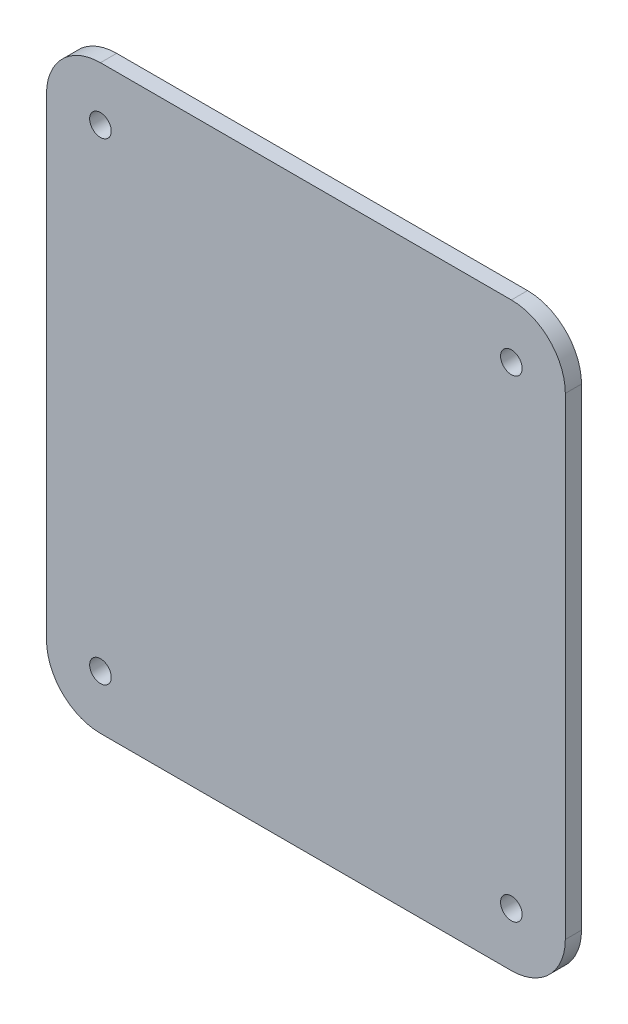
ISO-10303-21;
HEADER;
FILE_DESCRIPTION(('STEP AP214'),'2;1');
FILE_NAME('part.step','',(''),(''),'','','');
FILE_SCHEMA(('AUTOMOTIVE_DESIGN { 1 0 10303 214 1 1 1 1 }'));
ENDSEC;
DATA;
#1=APPLICATION_CONTEXT('core data for automotive mechanical design processes');
#2=APPLICATION_PROTOCOL_DEFINITION('international standard','automotive_design',2000,#1);
#3=PRODUCT_CONTEXT('',#1,'mechanical');
#4=PRODUCT('Part','Part','',(#3));
#5=PRODUCT_RELATED_PRODUCT_CATEGORY('part','',(#4));
#6=PRODUCT_DEFINITION_FORMATION('','',#4);
#7=PRODUCT_DEFINITION_CONTEXT('part definition',#1,'design');
#8=PRODUCT_DEFINITION('design','',#6,#7);
#9=PRODUCT_DEFINITION_SHAPE('','',#8);
#10=(LENGTH_UNIT() NAMED_UNIT(*) SI_UNIT(.MILLI.,.METRE.));
#11=(NAMED_UNIT(*) PLANE_ANGLE_UNIT() SI_UNIT($,.RADIAN.));
#12=(NAMED_UNIT(*) SI_UNIT($,.STERADIAN.) SOLID_ANGLE_UNIT());
#13=UNCERTAINTY_MEASURE_WITH_UNIT(LENGTH_MEASURE(1.E-05),#10,'distance_accuracy_value','');
#14=(GEOMETRIC_REPRESENTATION_CONTEXT(3) GLOBAL_UNCERTAINTY_ASSIGNED_CONTEXT((#13)) GLOBAL_UNIT_ASSIGNED_CONTEXT((#10,
#11,#12)) REPRESENTATION_CONTEXT('',''));
#15=CARTESIAN_POINT('',(0.,0.,0.));
#16=DIRECTION('',(0.,0.,1.));
#17=DIRECTION('',(1.,0.,0.));
#18=AXIS2_PLACEMENT_3D('',#15,#16,#17);
#19=CARTESIAN_POINT('',(36.15,-37.65,0.));
#20=DIRECTION('',(0.,0.,1.));
#21=DIRECTION('',(1.,0.,0.));
#22=AXIS2_PLACEMENT_3D('',#19,#20,#21);
#23=CYLINDRICAL_SURFACE('',#22,2.);
#24=CARTESIAN_POINT('',(36.15,-37.65,3.));
#25=DIRECTION('',(0.,0.,-1.));
#26=DIRECTION('',(1.,0.,0.));
#27=AXIS2_PLACEMENT_3D('',#24,#25,#26);
#28=CIRCLE('',#27,2.);
#29=CARTESIAN_POINT('',(34.15,-37.65,3.));
#30=VERTEX_POINT('',#29);
#31=EDGE_CURVE('E42',#30,#30,#28,.T.);
#32=ORIENTED_EDGE('',*,*,#31,.F.);
#33=DIRECTION('',(0.,0.,-1.));
#34=VECTOR('',#33,1.);
#35=CARTESIAN_POINT('',(34.15,-37.65,0.));
#36=LINE('',#35,#34);
#37=CARTESIAN_POINT('',(34.15,-37.65,0.));
#38=VERTEX_POINT('',#37);
#39=EDGE_CURVE('E10',#30,#38,#36,.T.);
#40=ORIENTED_EDGE('',*,*,#39,.T.);
#41=CARTESIAN_POINT('',(36.15,-37.65,0.));
#42=DIRECTION('',(0.,0.,1.));
#43=DIRECTION('',(1.,0.,0.));
#44=AXIS2_PLACEMENT_3D('',#41,#42,#43);
#45=CIRCLE('',#44,2.);
#46=EDGE_CURVE('E197',#38,#38,#45,.T.);
#47=ORIENTED_EDGE('',*,*,#46,.F.);
#48=ORIENTED_EDGE('',*,*,#39,.F.);
#49=EDGE_LOOP('',(#32,#40,#47,#48));
#50=FACE_BOUND('',#49,.T.);
#51=ADVANCED_FACE('F18',(#50),#23,.F.);
#52=CARTESIAN_POINT('',(-40.,-37.65,0.));
#53=DIRECTION('',(0.,0.,1.));
#54=DIRECTION('',(1.,0.,0.));
#55=AXIS2_PLACEMENT_3D('',#52,#53,#54);
#56=CYLINDRICAL_SURFACE('',#55,2.);
#57=CARTESIAN_POINT('',(-40.,-37.65,3.));
#58=DIRECTION('',(0.,0.,-1.));
#59=DIRECTION('',(1.,0.,0.));
#60=AXIS2_PLACEMENT_3D('',#57,#58,#59);
#61=CIRCLE('',#60,2.);
#62=CARTESIAN_POINT('',(-42.,-37.65,3.));
#63=VERTEX_POINT('',#62);
#64=EDGE_CURVE('E193',#63,#63,#61,.T.);
#65=ORIENTED_EDGE('',*,*,#64,.F.);
#66=DIRECTION('',(0.,0.,-1.));
#67=VECTOR('',#66,1.);
#68=CARTESIAN_POINT('',(-42.,-37.65,0.));
#69=LINE('',#68,#67);
#70=CARTESIAN_POINT('',(-42.,-37.65,0.));
#71=VERTEX_POINT('',#70);
#72=EDGE_CURVE('E29',#63,#71,#69,.T.);
#73=ORIENTED_EDGE('',*,*,#72,.T.);
#74=CARTESIAN_POINT('',(-40.,-37.65,0.));
#75=DIRECTION('',(0.,0.,1.));
#76=DIRECTION('',(1.,0.,0.));
#77=AXIS2_PLACEMENT_3D('',#74,#75,#76);
#78=CIRCLE('',#77,2.);
#79=EDGE_CURVE('E91',#71,#71,#78,.T.);
#80=ORIENTED_EDGE('',*,*,#79,.F.);
#81=ORIENTED_EDGE('',*,*,#72,.F.);
#82=EDGE_LOOP('',(#65,#73,#80,#81));
#83=FACE_BOUND('',#82,.T.);
#84=ADVANCED_FACE('F317',(#83),#56,.F.);
#85=CARTESIAN_POINT('',(36.15,50.,0.));
#86=DIRECTION('',(0.,0.,1.));
#87=DIRECTION('',(1.,0.,0.));
#88=AXIS2_PLACEMENT_3D('',#85,#86,#87);
#89=CYLINDRICAL_SURFACE('',#88,2.);
#90=CARTESIAN_POINT('',(36.15,50.,3.));
#91=DIRECTION('',(0.,0.,-1.));
#92=DIRECTION('',(1.,0.,0.));
#93=AXIS2_PLACEMENT_3D('',#90,#91,#92);
#94=CIRCLE('',#93,2.);
#95=CARTESIAN_POINT('',(34.15,50.,3.));
#96=VERTEX_POINT('',#95);
#97=EDGE_CURVE('E103',#96,#96,#94,.T.);
#98=ORIENTED_EDGE('',*,*,#97,.F.);
#99=DIRECTION('',(0.,0.,-1.));
#100=VECTOR('',#99,1.);
#101=CARTESIAN_POINT('',(34.15,50.,0.));
#102=LINE('',#101,#100);
#103=CARTESIAN_POINT('',(34.15,50.,0.));
#104=VERTEX_POINT('',#103);
#105=EDGE_CURVE('E207',#96,#104,#102,.T.);
#106=ORIENTED_EDGE('',*,*,#105,.T.);
#107=CARTESIAN_POINT('',(36.15,50.,0.));
#108=DIRECTION('',(0.,0.,1.));
#109=DIRECTION('',(1.,0.,0.));
#110=AXIS2_PLACEMENT_3D('',#107,#108,#109);
#111=CIRCLE('',#110,2.);
#112=EDGE_CURVE('E214',#104,#104,#111,.T.);
#113=ORIENTED_EDGE('',*,*,#112,.F.);
#114=ORIENTED_EDGE('',*,*,#105,.F.);
#115=EDGE_LOOP('',(#98,#106,#113,#114));
#116=FACE_BOUND('',#115,.T.);
#117=ADVANCED_FACE('F322',(#116),#89,.F.);
#118=CARTESIAN_POINT('',(-40.,50.,0.));
#119=DIRECTION('',(0.,0.,1.));
#120=DIRECTION('',(1.,0.,0.));
#121=AXIS2_PLACEMENT_3D('',#118,#119,#120);
#122=CYLINDRICAL_SURFACE('',#121,2.);
#123=CARTESIAN_POINT('',(-40.,50.,3.));
#124=DIRECTION('',(0.,0.,-1.));
#125=DIRECTION('',(1.,0.,0.));
#126=AXIS2_PLACEMENT_3D('',#123,#124,#125);
#127=CIRCLE('',#126,2.);
#128=CARTESIAN_POINT('',(-42.,50.,3.));
#129=VERTEX_POINT('',#128);
#130=EDGE_CURVE('E160',#129,#129,#127,.T.);
#131=ORIENTED_EDGE('',*,*,#130,.F.);
#132=DIRECTION('',(0.,0.,-1.));
#133=VECTOR('',#132,1.);
#134=CARTESIAN_POINT('',(-42.,50.,0.));
#135=LINE('',#134,#133);
#136=CARTESIAN_POINT('',(-42.,50.,0.));
#137=VERTEX_POINT('',#136);
#138=EDGE_CURVE('E169',#129,#137,#135,.T.);
#139=ORIENTED_EDGE('',*,*,#138,.T.);
#140=CARTESIAN_POINT('',(-40.,50.,0.));
#141=DIRECTION('',(0.,0.,1.));
#142=DIRECTION('',(1.,0.,0.));
#143=AXIS2_PLACEMENT_3D('',#140,#141,#142);
#144=CIRCLE('',#143,2.);
#145=EDGE_CURVE('E218',#137,#137,#144,.T.);
#146=ORIENTED_EDGE('',*,*,#145,.F.);
#147=ORIENTED_EDGE('',*,*,#138,.F.);
#148=EDGE_LOOP('',(#131,#139,#146,#147));
#149=FACE_BOUND('',#148,.T.);
#150=ADVANCED_FACE('F330',(#149),#122,.F.);
#151=CARTESIAN_POINT('',(-50.,50.,0.));
#152=DIRECTION('',(-1.,0.,0.));
#153=DIRECTION('',(0.,1.,0.));
#154=AXIS2_PLACEMENT_3D('',#151,#152,#153);
#155=PLANE('',#154);
#156=DIRECTION('',(0.,1.,0.));
#157=VECTOR('',#156,1.);
#158=CARTESIAN_POINT('',(-50.,-37.65,0.));
#159=LINE('',#158,#157);
#160=CARTESIAN_POINT('',(-50.,-37.65,0.));
#161=VERTEX_POINT('',#160);
#162=CARTESIAN_POINT('',(-50.,50.,0.));
#163=VERTEX_POINT('',#162);
#164=EDGE_CURVE('E164',#161,#163,#159,.T.);
#165=ORIENTED_EDGE('',*,*,#164,.F.);
#166=DIRECTION('',(0.,0.,1.));
#167=VECTOR('',#166,1.);
#168=CARTESIAN_POINT('',(-50.,-37.65,0.));
#169=LINE('',#168,#167);
#170=CARTESIAN_POINT('',(-50.,-37.65,3.));
#171=VERTEX_POINT('',#170);
#172=EDGE_CURVE('E162',#161,#171,#169,.T.);
#173=ORIENTED_EDGE('',*,*,#172,.T.);
#174=DIRECTION('',(0.,-1.,0.));
#175=VECTOR('',#174,1.);
#176=CARTESIAN_POINT('',(-50.,-37.65,3.));
#177=LINE('',#176,#175);
#178=CARTESIAN_POINT('',(-50.,50.,3.));
#179=VERTEX_POINT('',#178);
#180=EDGE_CURVE('E22',#179,#171,#177,.T.);
#181=ORIENTED_EDGE('',*,*,#180,.F.);
#182=DIRECTION('',(0.,0.,1.));
#183=VECTOR('',#182,1.);
#184=CARTESIAN_POINT('',(-50.,50.,0.));
#185=LINE('',#184,#183);
#186=EDGE_CURVE('E203',#163,#179,#185,.T.);
#187=ORIENTED_EDGE('',*,*,#186,.F.);
#188=EDGE_LOOP('',(#165,#173,#181,#187));
#189=FACE_BOUND('',#188,.T.);
#190=ADVANCED_FACE('F163',(#189),#155,.T.);
#191=CARTESIAN_POINT('',(-40.,50.,0.));
#192=DIRECTION('',(0.,0.,1.));
#193=DIRECTION('',(0.,1.,0.));
#194=AXIS2_PLACEMENT_3D('',#191,#192,#193);
#195=CYLINDRICAL_SURFACE('',#194,10.);
#196=CARTESIAN_POINT('',(-40.,50.,0.));
#197=DIRECTION('',(0.,0.,1.));
#198=DIRECTION('',(0.,1.,0.));
#199=AXIS2_PLACEMENT_3D('',#196,#197,#198);
#200=CIRCLE('',#199,10.);
#201=CARTESIAN_POINT('',(-40.,60.,0.));
#202=VERTEX_POINT('',#201);
#203=EDGE_CURVE('E170',#202,#163,#200,.T.);
#204=ORIENTED_EDGE('',*,*,#203,.T.);
#205=ORIENTED_EDGE('',*,*,#186,.T.);
#206=CARTESIAN_POINT('',(-40.,50.,3.));
#207=DIRECTION('',(0.,0.,1.));
#208=DIRECTION('',(0.,1.,0.));
#209=AXIS2_PLACEMENT_3D('',#206,#207,#208);
#210=CIRCLE('',#209,10.);
#211=CARTESIAN_POINT('',(-40.,60.,3.));
#212=VERTEX_POINT('',#211);
#213=EDGE_CURVE('E129',#212,#179,#210,.T.);
#214=ORIENTED_EDGE('',*,*,#213,.F.);
#215=DIRECTION('',(0.,0.,1.));
#216=VECTOR('',#215,1.);
#217=CARTESIAN_POINT('',(-40.,60.,0.));
#218=LINE('',#217,#216);
#219=EDGE_CURVE('E136',#202,#212,#218,.T.);
#220=ORIENTED_EDGE('',*,*,#219,.F.);
#221=EDGE_LOOP('',(#204,#205,#214,#220));
#222=FACE_BOUND('',#221,.T.);
#223=ADVANCED_FACE('F306',(#222),#195,.T.);
#224=CARTESIAN_POINT('',(36.15,60.,0.));
#225=DIRECTION('',(0.,1.,0.));
#226=DIRECTION('',(1.,0.,0.));
#227=AXIS2_PLACEMENT_3D('',#224,#225,#226);
#228=PLANE('',#227);
#229=DIRECTION('',(1.,0.,0.));
#230=VECTOR('',#229,1.);
#231=CARTESIAN_POINT('',(-40.,60.,0.));
#232=LINE('',#231,#230);
#233=CARTESIAN_POINT('',(36.15,60.,0.));
#234=VERTEX_POINT('',#233);
#235=EDGE_CURVE('E192',#202,#234,#232,.T.);
#236=ORIENTED_EDGE('',*,*,#235,.F.);
#237=ORIENTED_EDGE('',*,*,#219,.T.);
#238=DIRECTION('',(-1.,0.,0.));
#239=VECTOR('',#238,1.);
#240=CARTESIAN_POINT('',(-40.,60.,3.));
#241=LINE('',#240,#239);
#242=CARTESIAN_POINT('',(36.15,60.,3.));
#243=VERTEX_POINT('',#242);
#244=EDGE_CURVE('E210',#243,#212,#241,.T.);
#245=ORIENTED_EDGE('',*,*,#244,.F.);
#246=DIRECTION('',(0.,0.,1.));
#247=VECTOR('',#246,1.);
#248=CARTESIAN_POINT('',(36.15,60.,0.));
#249=LINE('',#248,#247);
#250=EDGE_CURVE('E234',#234,#243,#249,.T.);
#251=ORIENTED_EDGE('',*,*,#250,.F.);
#252=EDGE_LOOP('',(#236,#237,#245,#251));
#253=FACE_BOUND('',#252,.T.);
#254=ADVANCED_FACE('F304',(#253),#228,.T.);
#255=CARTESIAN_POINT('',(36.15,50.,0.));
#256=DIRECTION('',(0.,0.,1.));
#257=DIRECTION('',(1.,0.,0.));
#258=AXIS2_PLACEMENT_3D('',#255,#256,#257);
#259=CYLINDRICAL_SURFACE('',#258,10.);
#260=CARTESIAN_POINT('',(36.15,50.,0.));
#261=DIRECTION('',(0.,0.,1.));
#262=DIRECTION('',(1.,0.,0.));
#263=AXIS2_PLACEMENT_3D('',#260,#261,#262);
#264=CIRCLE('',#263,10.);
#265=CARTESIAN_POINT('',(46.15,50.,0.));
#266=VERTEX_POINT('',#265);
#267=EDGE_CURVE('E204',#266,#234,#264,.T.);
#268=ORIENTED_EDGE('',*,*,#267,.T.);
#269=ORIENTED_EDGE('',*,*,#250,.T.);
#270=CARTESIAN_POINT('',(36.15,50.,3.));
#271=DIRECTION('',(0.,0.,1.));
#272=DIRECTION('',(1.,0.,0.));
#273=AXIS2_PLACEMENT_3D('',#270,#271,#272);
#274=CIRCLE('',#273,10.);
#275=CARTESIAN_POINT('',(46.15,50.,3.));
#276=VERTEX_POINT('',#275);
#277=EDGE_CURVE('E213',#276,#243,#274,.T.);
#278=ORIENTED_EDGE('',*,*,#277,.F.);
#279=DIRECTION('',(0.,0.,1.));
#280=VECTOR('',#279,1.);
#281=CARTESIAN_POINT('',(46.15,50.,0.));
#282=LINE('',#281,#280);
#283=EDGE_CURVE('E230',#266,#276,#282,.T.);
#284=ORIENTED_EDGE('',*,*,#283,.F.);
#285=EDGE_LOOP('',(#268,#269,#278,#284));
#286=FACE_BOUND('',#285,.T.);
#287=ADVANCED_FACE('F299',(#286),#259,.T.);
#288=CARTESIAN_POINT('',(46.15,-37.65,0.));
#289=DIRECTION('',(1.,0.,0.));
#290=DIRECTION('',(0.,1.,0.));
#291=AXIS2_PLACEMENT_3D('',#288,#289,#290);
#292=PLANE('',#291);
#293=DIRECTION('',(0.,-1.,0.));
#294=VECTOR('',#293,1.);
#295=CARTESIAN_POINT('',(46.15,50.,0.));
#296=LINE('',#295,#294);
#297=CARTESIAN_POINT('',(46.15,-37.65,0.));
#298=VERTEX_POINT('',#297);
#299=EDGE_CURVE('E222',#266,#298,#296,.T.);
#300=ORIENTED_EDGE('',*,*,#299,.F.);
#301=ORIENTED_EDGE('',*,*,#283,.T.);
#302=DIRECTION('',(0.,1.,0.));
#303=VECTOR('',#302,1.);
#304=CARTESIAN_POINT('',(46.15,50.,3.));
#305=LINE('',#304,#303);
#306=CARTESIAN_POINT('',(46.15,-37.65,3.));
#307=VERTEX_POINT('',#306);
#308=EDGE_CURVE('E241',#307,#276,#305,.T.);
#309=ORIENTED_EDGE('',*,*,#308,.F.);
#310=DIRECTION('',(0.,0.,1.));
#311=VECTOR('',#310,1.);
#312=CARTESIAN_POINT('',(46.15,-37.65,0.));
#313=LINE('',#312,#311);
#314=EDGE_CURVE('E252',#298,#307,#313,.T.);
#315=ORIENTED_EDGE('',*,*,#314,.F.);
#316=EDGE_LOOP('',(#300,#301,#309,#315));
#317=FACE_BOUND('',#316,.T.);
#318=ADVANCED_FACE('F295',(#317),#292,.T.);
#319=CARTESIAN_POINT('',(36.15,-37.65,0.));
#320=DIRECTION('',(0.,0.,1.));
#321=DIRECTION('',(0.,-1.,0.));
#322=AXIS2_PLACEMENT_3D('',#319,#320,#321);
#323=CYLINDRICAL_SURFACE('',#322,10.);
#324=CARTESIAN_POINT('',(36.15,-37.65,0.));
#325=DIRECTION('',(0.,0.,1.));
#326=DIRECTION('',(0.,-1.,0.));
#327=AXIS2_PLACEMENT_3D('',#324,#325,#326);
#328=CIRCLE('',#327,10.);
#329=CARTESIAN_POINT('',(36.15,-47.65,0.));
#330=VERTEX_POINT('',#329);
#331=EDGE_CURVE('E235',#330,#298,#328,.T.);
#332=ORIENTED_EDGE('',*,*,#331,.T.);
#333=ORIENTED_EDGE('',*,*,#314,.T.);
#334=CARTESIAN_POINT('',(36.15,-37.65,3.));
#335=DIRECTION('',(0.,0.,1.));
#336=DIRECTION('',(0.,-1.,0.));
#337=AXIS2_PLACEMENT_3D('',#334,#335,#336);
#338=CIRCLE('',#337,10.);
#339=CARTESIAN_POINT('',(36.15,-47.65,3.));
#340=VERTEX_POINT('',#339);
#341=EDGE_CURVE('E186',#340,#307,#338,.T.);
#342=ORIENTED_EDGE('',*,*,#341,.F.);
#343=DIRECTION('',(0.,0.,1.));
#344=VECTOR('',#343,1.);
#345=CARTESIAN_POINT('',(36.15,-47.65,0.));
#346=LINE('',#345,#344);
#347=EDGE_CURVE('E248',#330,#340,#346,.T.);
#348=ORIENTED_EDGE('',*,*,#347,.F.);
#349=EDGE_LOOP('',(#332,#333,#342,#348));
#350=FACE_BOUND('',#349,.T.);
#351=ADVANCED_FACE('F291',(#350),#323,.T.);
#352=CARTESIAN_POINT('',(-40.,-47.65,0.));
#353=DIRECTION('',(0.,-1.,0.));
#354=DIRECTION('',(0.,0.,-1.));
#355=AXIS2_PLACEMENT_3D('',#352,#353,#354);
#356=PLANE('',#355);
#357=DIRECTION('',(-1.,0.,0.));
#358=VECTOR('',#357,1.);
#359=CARTESIAN_POINT('',(36.15,-47.65,0.));
#360=LINE('',#359,#358);
#361=CARTESIAN_POINT('',(-40.,-47.65,0.));
#362=VERTEX_POINT('',#361);
#363=EDGE_CURVE('E225',#330,#362,#360,.T.);
#364=ORIENTED_EDGE('',*,*,#363,.F.);
#365=ORIENTED_EDGE('',*,*,#347,.T.);
#366=DIRECTION('',(1.,0.,0.));
#367=VECTOR('',#366,1.);
#368=CARTESIAN_POINT('',(36.15,-47.65,3.));
#369=LINE('',#368,#367);
#370=CARTESIAN_POINT('',(-40.,-47.65,3.));
#371=VERTEX_POINT('',#370);
#372=EDGE_CURVE('E177',#371,#340,#369,.T.);
#373=ORIENTED_EDGE('',*,*,#372,.F.);
#374=DIRECTION('',(0.,0.,1.));
#375=VECTOR('',#374,1.);
#376=CARTESIAN_POINT('',(-40.,-47.65,0.));
#377=LINE('',#376,#375);
#378=EDGE_CURVE('E175',#362,#371,#377,.T.);
#379=ORIENTED_EDGE('',*,*,#378,.F.);
#380=EDGE_LOOP('',(#364,#365,#373,#379));
#381=FACE_BOUND('',#380,.T.);
#382=ADVANCED_FACE('F20',(#381),#356,.T.);
#383=CARTESIAN_POINT('',(-40.,-37.65,0.));
#384=DIRECTION('',(0.,0.,1.));
#385=DIRECTION('',(-1.,0.,0.));
#386=AXIS2_PLACEMENT_3D('',#383,#384,#385);
#387=CYLINDRICAL_SURFACE('',#386,10.);
#388=CARTESIAN_POINT('',(-40.,-37.65,0.));
#389=DIRECTION('',(0.,0.,1.));
#390=DIRECTION('',(-1.,0.,0.));
#391=AXIS2_PLACEMENT_3D('',#388,#389,#390);
#392=CIRCLE('',#391,10.);
#393=EDGE_CURVE('E184',#161,#362,#392,.T.);
#394=ORIENTED_EDGE('',*,*,#393,.T.);
#395=ORIENTED_EDGE('',*,*,#378,.T.);
#396=CARTESIAN_POINT('',(-40.,-37.65,3.));
#397=DIRECTION('',(0.,0.,1.));
#398=DIRECTION('',(-1.,0.,0.));
#399=AXIS2_PLACEMENT_3D('',#396,#397,#398);
#400=CIRCLE('',#399,10.);
#401=EDGE_CURVE('E155',#171,#371,#400,.T.);
#402=ORIENTED_EDGE('',*,*,#401,.F.);
#403=ORIENTED_EDGE('',*,*,#172,.F.);
#404=EDGE_LOOP('',(#394,#395,#402,#403));
#405=FACE_BOUND('',#404,.T.);
#406=ADVANCED_FACE('F173',(#405),#387,.T.);
#407=CARTESIAN_POINT('',(-1.925,6.175,3.));
#408=DIRECTION('',(0.,0.,1.));
#409=DIRECTION('',(1.,0.,0.));
#410=AXIS2_PLACEMENT_3D('',#407,#408,#409);
#411=PLANE('',#410);
#412=ORIENTED_EDGE('',*,*,#401,.T.);
#413=ORIENTED_EDGE('',*,*,#372,.T.);
#414=ORIENTED_EDGE('',*,*,#341,.T.);
#415=ORIENTED_EDGE('',*,*,#308,.T.);
#416=ORIENTED_EDGE('',*,*,#277,.T.);
#417=ORIENTED_EDGE('',*,*,#244,.T.);
#418=ORIENTED_EDGE('',*,*,#213,.T.);
#419=ORIENTED_EDGE('',*,*,#180,.T.);
#420=EDGE_LOOP('',(#412,#413,#414,#415,#416,#417,#418,#419));
#421=FACE_BOUND('',#420,.T.);
#422=ORIENTED_EDGE('',*,*,#130,.T.);
#423=EDGE_LOOP('',(#422));
#424=FACE_BOUND('',#423,.T.);
#425=ORIENTED_EDGE('',*,*,#97,.T.);
#426=EDGE_LOOP('',(#425));
#427=FACE_BOUND('',#426,.T.);
#428=ORIENTED_EDGE('',*,*,#64,.T.);
#429=EDGE_LOOP('',(#428));
#430=FACE_BOUND('',#429,.T.);
#431=ORIENTED_EDGE('',*,*,#31,.T.);
#432=EDGE_LOOP('',(#431));
#433=FACE_BOUND('',#432,.T.);
#434=ADVANCED_FACE('F151',(#421,#424,#427,#430,#433),#411,.T.);
#435=CARTESIAN_POINT('',(-1.925,6.175,0.));
#436=DIRECTION('',(0.,0.,1.));
#437=DIRECTION('',(1.,0.,0.));
#438=AXIS2_PLACEMENT_3D('',#435,#436,#437);
#439=PLANE('',#438);
#440=ORIENTED_EDGE('',*,*,#393,.F.);
#441=ORIENTED_EDGE('',*,*,#164,.T.);
#442=ORIENTED_EDGE('',*,*,#203,.F.);
#443=ORIENTED_EDGE('',*,*,#235,.T.);
#444=ORIENTED_EDGE('',*,*,#267,.F.);
#445=ORIENTED_EDGE('',*,*,#299,.T.);
#446=ORIENTED_EDGE('',*,*,#331,.F.);
#447=ORIENTED_EDGE('',*,*,#363,.T.);
#448=EDGE_LOOP('',(#440,#441,#442,#443,#444,#445,#446,#447));
#449=FACE_BOUND('',#448,.T.);
#450=ORIENTED_EDGE('',*,*,#145,.T.);
#451=EDGE_LOOP('',(#450));
#452=FACE_BOUND('',#451,.T.);
#453=ORIENTED_EDGE('',*,*,#112,.T.);
#454=EDGE_LOOP('',(#453));
#455=FACE_BOUND('',#454,.T.);
#456=ORIENTED_EDGE('',*,*,#79,.T.);
#457=EDGE_LOOP('',(#456));
#458=FACE_BOUND('',#457,.T.);
#459=ORIENTED_EDGE('',*,*,#46,.T.);
#460=EDGE_LOOP('',(#459));
#461=FACE_BOUND('',#460,.T.);
#462=ADVANCED_FACE('F259',(#449,#452,#455,#458,#461),#439,.F.);
#463=CLOSED_SHELL('',(#51,#84,#117,#150,#190,#223,#254,#287,#318,#351,#382,#406,#434,#462));
#464=MANIFOLD_SOLID_BREP('B1',#463);
#465=ADVANCED_BREP_SHAPE_REPRESENTATION('',(#18,#464),#14);
#466=SHAPE_DEFINITION_REPRESENTATION(#9,#465);
ENDSEC;
END-ISO-10303-21;
